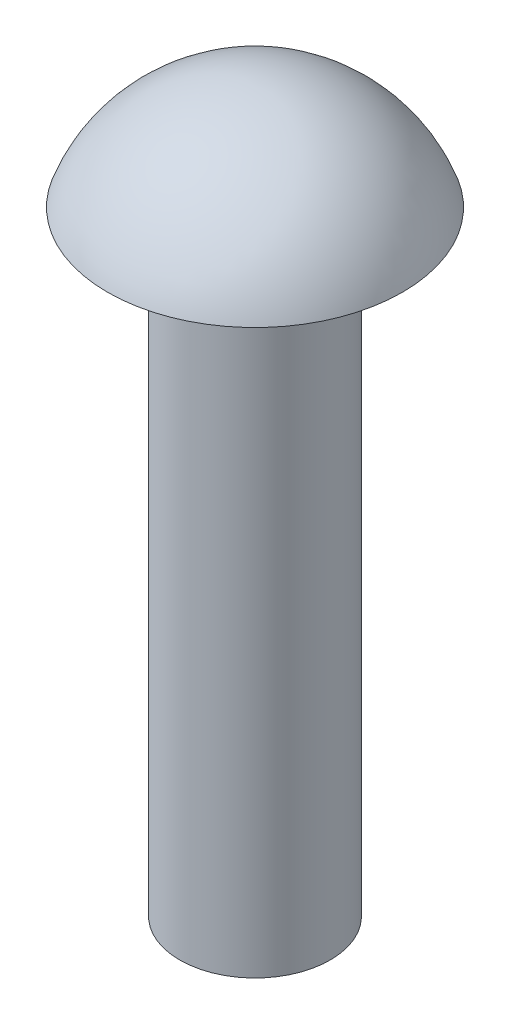
ISO-10303-21;
HEADER;
FILE_DESCRIPTION(('STEP AP214'),'2;1');
FILE_NAME('part.step','',(''),(''),'','','');
FILE_SCHEMA(('AUTOMOTIVE_DESIGN { 1 0 10303 214 1 1 1 1 }'));
ENDSEC;
DATA;
#1=APPLICATION_CONTEXT('core data for automotive mechanical design processes');
#2=APPLICATION_PROTOCOL_DEFINITION('international standard','automotive_design',2000,#1);
#3=PRODUCT_CONTEXT('',#1,'mechanical');
#4=PRODUCT('Part','Part','',(#3));
#5=PRODUCT_RELATED_PRODUCT_CATEGORY('part','',(#4));
#6=PRODUCT_DEFINITION_FORMATION('','',#4);
#7=PRODUCT_DEFINITION_CONTEXT('part definition',#1,'design');
#8=PRODUCT_DEFINITION('design','',#6,#7);
#9=PRODUCT_DEFINITION_SHAPE('','',#8);
#10=(LENGTH_UNIT() NAMED_UNIT(*) SI_UNIT(.MILLI.,.METRE.));
#11=(NAMED_UNIT(*) PLANE_ANGLE_UNIT() SI_UNIT($,.RADIAN.));
#12=(NAMED_UNIT(*) SI_UNIT($,.STERADIAN.) SOLID_ANGLE_UNIT());
#13=UNCERTAINTY_MEASURE_WITH_UNIT(LENGTH_MEASURE(1.E-05),#10,'distance_accuracy_value','');
#14=(GEOMETRIC_REPRESENTATION_CONTEXT(3) GLOBAL_UNCERTAINTY_ASSIGNED_CONTEXT((#13)) GLOBAL_UNIT_ASSIGNED_CONTEXT((#10,
#11,#12)) REPRESENTATION_CONTEXT('',''));
#15=CARTESIAN_POINT('',(0.,0.,0.));
#16=DIRECTION('',(0.,0.,1.));
#17=DIRECTION('',(1.,0.,0.));
#18=AXIS2_PLACEMENT_3D('',#15,#16,#17);
#19=CARTESIAN_POINT('',(0.,-2.54411764705882,0.));
#20=DIRECTION('',(0.,1.,0.));
#21=DIRECTION('',(0.,0.,-1.));
#22=AXIS2_PLACEMENT_3D('',#19,#20,#21);
#23=SPHERICAL_SURFACE('',#22,2.54411764705882);
#24=CARTESIAN_POINT('',(0.,-1.7,0.));
#25=DIRECTION('',(0.,1.,0.));
#26=DIRECTION('',(0.,0.,1.));
#27=AXIS2_PLACEMENT_3D('',#24,#25,#26);
#28=CIRCLE('',#27,2.4);
#29=CARTESIAN_POINT('',(0.,-1.7,2.4));
#30=VERTEX_POINT('',#29);
#31=EDGE_CURVE('E47',#30,#30,#28,.T.);
#32=ORIENTED_EDGE('',*,*,#31,.T.);
#33=EDGE_LOOP('',(#32));
#34=FACE_BOUND('',#33,.T.);
#35=ADVANCED_FACE('F37',(#34),#23,.T.);
#36=CARTESIAN_POINT('',(0.,-11.7,0.));
#37=DIRECTION('',(0.,1.,0.));
#38=DIRECTION('',(0.,0.,1.));
#39=AXIS2_PLACEMENT_3D('',#36,#37,#38);
#40=PLANE('',#39);
#41=CARTESIAN_POINT('',(0.,-11.7,0.));
#42=DIRECTION('',(0.,1.,0.));
#43=DIRECTION('',(0.,0.,1.));
#44=AXIS2_PLACEMENT_3D('',#41,#42,#43);
#45=CIRCLE('',#44,1.225);
#46=CARTESIAN_POINT('',(0.,-11.7,1.225));
#47=VERTEX_POINT('',#46);
#48=EDGE_CURVE('E10',#47,#47,#45,.T.);
#49=ORIENTED_EDGE('',*,*,#48,.F.);
#50=EDGE_LOOP('',(#49));
#51=FACE_BOUND('',#50,.T.);
#52=ADVANCED_FACE('F62',(#51),#40,.F.);
#53=CARTESIAN_POINT('',(0.,0.,0.));
#54=DIRECTION('',(0.,1.,0.));
#55=DIRECTION('',(0.,0.,1.));
#56=AXIS2_PLACEMENT_3D('',#53,#54,#55);
#57=CYLINDRICAL_SURFACE('',#56,1.225);
#58=CARTESIAN_POINT('',(0.,-1.7,0.));
#59=DIRECTION('',(0.,1.,0.));
#60=DIRECTION('',(0.,0.,1.));
#61=AXIS2_PLACEMENT_3D('',#58,#59,#60);
#62=CIRCLE('',#61,1.225);
#63=CARTESIAN_POINT('',(0.,-1.7,1.225));
#64=VERTEX_POINT('',#63);
#65=EDGE_CURVE('E43',#64,#64,#62,.T.);
#66=ORIENTED_EDGE('',*,*,#65,.F.);
#67=EDGE_LOOP('',(#66));
#68=FACE_BOUND('',#67,.T.);
#69=ORIENTED_EDGE('',*,*,#48,.T.);
#70=EDGE_LOOP('',(#69));
#71=FACE_BOUND('',#70,.T.);
#72=ADVANCED_FACE('F57',(#68,#71),#57,.T.);
#73=CARTESIAN_POINT('',(0.,-1.7,-1.225));
#74=DIRECTION('',(0.,1.,0.));
#75=DIRECTION('',(0.,0.,1.));
#76=AXIS2_PLACEMENT_3D('',#73,#74,#75);
#77=PLANE('',#76);
#78=ORIENTED_EDGE('',*,*,#31,.F.);
#79=EDGE_LOOP('',(#78));
#80=FACE_BOUND('',#79,.T.);
#81=ORIENTED_EDGE('',*,*,#65,.T.);
#82=EDGE_LOOP('',(#81));
#83=FACE_BOUND('',#82,.T.);
#84=ADVANCED_FACE('F55',(#80,#83),#77,.F.);
#85=CLOSED_SHELL('',(#35,#52,#72,#84));
#86=MANIFOLD_SOLID_BREP('B2',#85);
#87=ADVANCED_BREP_SHAPE_REPRESENTATION('',(#18,#86),#14);
#88=SHAPE_DEFINITION_REPRESENTATION(#9,#87);
ENDSEC;
END-ISO-10303-21;
